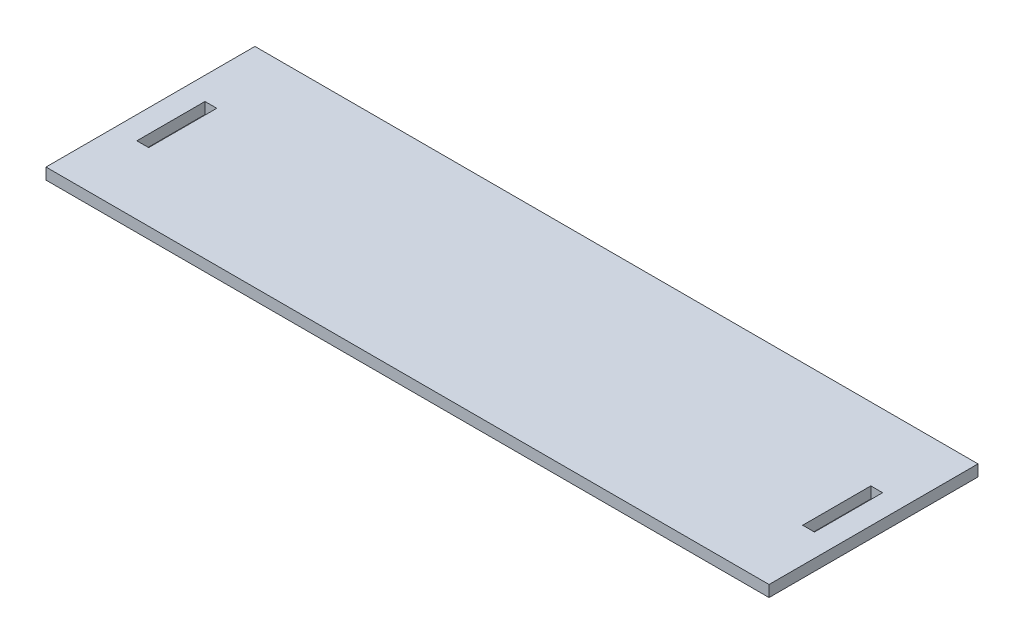
ISO-10303-21;
HEADER;
FILE_DESCRIPTION(('STEP AP214'),'2;1');
FILE_NAME('part.step','',(''),(''),'','','');
FILE_SCHEMA(('AUTOMOTIVE_DESIGN { 1 0 10303 214 1 1 1 1 }'));
ENDSEC;
DATA;
#1=APPLICATION_CONTEXT('core data for automotive mechanical design processes');
#2=APPLICATION_PROTOCOL_DEFINITION('international standard','automotive_design',2000,#1);
#3=PRODUCT_CONTEXT('',#1,'mechanical');
#4=PRODUCT('Part','Part','',(#3));
#5=PRODUCT_RELATED_PRODUCT_CATEGORY('part','',(#4));
#6=PRODUCT_DEFINITION_FORMATION('','',#4);
#7=PRODUCT_DEFINITION_CONTEXT('part definition',#1,'design');
#8=PRODUCT_DEFINITION('design','',#6,#7);
#9=PRODUCT_DEFINITION_SHAPE('','',#8);
#10=(LENGTH_UNIT() NAMED_UNIT(*) SI_UNIT(.MILLI.,.METRE.));
#11=(NAMED_UNIT(*) PLANE_ANGLE_UNIT() SI_UNIT($,.RADIAN.));
#12=(NAMED_UNIT(*) SI_UNIT($,.STERADIAN.) SOLID_ANGLE_UNIT());
#13=UNCERTAINTY_MEASURE_WITH_UNIT(LENGTH_MEASURE(1.E-05),#10,'distance_accuracy_value','');
#14=(GEOMETRIC_REPRESENTATION_CONTEXT(3) GLOBAL_UNCERTAINTY_ASSIGNED_CONTEXT((#13)) GLOBAL_UNIT_ASSIGNED_CONTEXT((#10,
#11,#12)) REPRESENTATION_CONTEXT('',''));
#15=CARTESIAN_POINT('',(0.,0.,0.));
#16=DIRECTION('',(0.,0.,1.));
#17=DIRECTION('',(1.,0.,0.));
#18=AXIS2_PLACEMENT_3D('',#15,#16,#17);
#19=CARTESIAN_POINT('',(0.,2.5,0.));
#20=DIRECTION('',(0.,-1.,0.));
#21=DIRECTION('',(0.,0.,-1.));
#22=AXIS2_PLACEMENT_3D('',#19,#20,#21);
#23=PLANE('',#22);
#24=DIRECTION('',(0.,0.,-1.));
#25=VECTOR('',#24,1.);
#26=CARTESIAN_POINT('',(-72.,2.5,7.49999999999999));
#27=LINE('',#26,#25);
#28=CARTESIAN_POINT('',(-72.,2.5,7.49999999999999));
#29=VERTEX_POINT('',#28);
#30=CARTESIAN_POINT('',(-72.,2.5,-7.50000000000001));
#31=VERTEX_POINT('',#30);
#32=EDGE_CURVE('E177',#29,#31,#27,.T.);
#33=ORIENTED_EDGE('',*,*,#32,.F.);
#34=DIRECTION('',(1.,0.,0.));
#35=VECTOR('',#34,1.);
#36=CARTESIAN_POINT('',(-74.6,2.5,7.49999999999999));
#37=LINE('',#36,#35);
#38=CARTESIAN_POINT('',(-74.6,2.5,7.49999999999999));
#39=VERTEX_POINT('',#38);
#40=EDGE_CURVE('E173',#39,#29,#37,.T.);
#41=ORIENTED_EDGE('',*,*,#40,.F.);
#42=DIRECTION('',(0.,0.,1.));
#43=VECTOR('',#42,1.);
#44=CARTESIAN_POINT('',(-74.6,2.5,7.49999999999999));
#45=LINE('',#44,#43);
#46=CARTESIAN_POINT('',(-74.6,2.5,-7.50000000000001));
#47=VERTEX_POINT('',#46);
#48=EDGE_CURVE('E189',#47,#39,#45,.T.);
#49=ORIENTED_EDGE('',*,*,#48,.F.);
#50=DIRECTION('',(-1.,0.,0.));
#51=VECTOR('',#50,1.);
#52=CARTESIAN_POINT('',(-74.6,2.5,-7.50000000000001));
#53=LINE('',#52,#51);
#54=EDGE_CURVE('E192',#31,#47,#53,.T.);
#55=ORIENTED_EDGE('',*,*,#54,.F.);
#56=EDGE_LOOP('',(#33,#41,#49,#55));
#57=FACE_BOUND('',#56,.T.);
#58=DIRECTION('',(0.,0.,-1.));
#59=VECTOR('',#58,1.);
#60=CARTESIAN_POINT('',(79.6,2.5,22.5));
#61=LINE('',#60,#59);
#62=CARTESIAN_POINT('',(79.6,2.5,22.5));
#63=VERTEX_POINT('',#62);
#64=CARTESIAN_POINT('',(79.6,2.5,-23.5));
#65=VERTEX_POINT('',#64);
#66=EDGE_CURVE('E159',#63,#65,#61,.T.);
#67=ORIENTED_EDGE('',*,*,#66,.T.);
#68=DIRECTION('',(1.,0.,0.));
#69=VECTOR('',#68,1.);
#70=CARTESIAN_POINT('',(0.,2.5,-23.5));
#71=LINE('',#70,#69);
#72=CARTESIAN_POINT('',(-79.6,2.5,-23.5));
#73=VERTEX_POINT('',#72);
#74=EDGE_CURVE('E129',#73,#65,#71,.T.);
#75=ORIENTED_EDGE('',*,*,#74,.F.);
#76=DIRECTION('',(0.,0.,1.));
#77=VECTOR('',#76,1.);
#78=CARTESIAN_POINT('',(-79.6,2.5,22.5));
#79=LINE('',#78,#77);
#80=CARTESIAN_POINT('',(-79.6,2.5,22.5));
#81=VERTEX_POINT('',#80);
#82=EDGE_CURVE('E160',#73,#81,#79,.T.);
#83=ORIENTED_EDGE('',*,*,#82,.T.);
#84=DIRECTION('',(1.,0.,0.));
#85=VECTOR('',#84,1.);
#86=CARTESIAN_POINT('',(-79.6,2.5,22.5));
#87=LINE('',#86,#85);
#88=EDGE_CURVE('E156',#81,#63,#87,.T.);
#89=ORIENTED_EDGE('',*,*,#88,.T.);
#90=EDGE_LOOP('',(#67,#75,#83,#89));
#91=FACE_BOUND('',#90,.T.);
#92=DIRECTION('',(0.,0.,-1.));
#93=VECTOR('',#92,1.);
#94=CARTESIAN_POINT('',(74.6,2.5,7.49999999999997));
#95=LINE('',#94,#93);
#96=CARTESIAN_POINT('',(74.6,2.5,7.49999999999997));
#97=VERTEX_POINT('',#96);
#98=CARTESIAN_POINT('',(74.6,2.5,-7.50000000000003));
#99=VERTEX_POINT('',#98);
#100=EDGE_CURVE('E207',#97,#99,#95,.T.);
#101=ORIENTED_EDGE('',*,*,#100,.F.);
#102=DIRECTION('',(1.,0.,0.));
#103=VECTOR('',#102,1.);
#104=CARTESIAN_POINT('',(74.6,2.5,7.49999999999997));
#105=LINE('',#104,#103);
#106=CARTESIAN_POINT('',(72.,2.5,7.49999999999997));
#107=VERTEX_POINT('',#106);
#108=EDGE_CURVE('E203',#107,#97,#105,.T.);
#109=ORIENTED_EDGE('',*,*,#108,.F.);
#110=DIRECTION('',(0.,0.,1.));
#111=VECTOR('',#110,1.);
#112=CARTESIAN_POINT('',(72.,2.5,7.49999999999997));
#113=LINE('',#112,#111);
#114=CARTESIAN_POINT('',(72.,2.5,-7.50000000000003));
#115=VERTEX_POINT('',#114);
#116=EDGE_CURVE('E217',#115,#107,#113,.T.);
#117=ORIENTED_EDGE('',*,*,#116,.F.);
#118=DIRECTION('',(-1.,0.,0.));
#119=VECTOR('',#118,1.);
#120=CARTESIAN_POINT('',(74.6,2.5,-7.50000000000003));
#121=LINE('',#120,#119);
#122=EDGE_CURVE('E219',#99,#115,#121,.T.);
#123=ORIENTED_EDGE('',*,*,#122,.F.);
#124=EDGE_LOOP('',(#101,#109,#117,#123));
#125=FACE_BOUND('',#124,.T.);
#126=ADVANCED_FACE('F39',(#57,#91,#125),#23,.F.);
#127=CARTESIAN_POINT('',(0.,0.,0.));
#128=DIRECTION('',(0.,-1.,0.));
#129=DIRECTION('',(0.,0.,-1.));
#130=AXIS2_PLACEMENT_3D('',#127,#128,#129);
#131=PLANE('',#130);
#132=DIRECTION('',(1.,0.,0.));
#133=VECTOR('',#132,1.);
#134=CARTESIAN_POINT('',(0.,0.,-23.5));
#135=LINE('',#134,#133);
#136=CARTESIAN_POINT('',(-79.6,0.,-23.5));
#137=VERTEX_POINT('',#136);
#138=CARTESIAN_POINT('',(79.6,0.,-23.5));
#139=VERTEX_POINT('',#138);
#140=EDGE_CURVE('E54',#137,#139,#135,.T.);
#141=ORIENTED_EDGE('',*,*,#140,.T.);
#142=DIRECTION('',(0.,0.,-1.));
#143=VECTOR('',#142,1.);
#144=CARTESIAN_POINT('',(79.6,0.,22.5));
#145=LINE('',#144,#143);
#146=CARTESIAN_POINT('',(79.6,0.,22.5));
#147=VERTEX_POINT('',#146);
#148=EDGE_CURVE('E143',#147,#139,#145,.T.);
#149=ORIENTED_EDGE('',*,*,#148,.F.);
#150=DIRECTION('',(1.,0.,0.));
#151=VECTOR('',#150,1.);
#152=CARTESIAN_POINT('',(-79.6,0.,22.5));
#153=LINE('',#152,#151);
#154=CARTESIAN_POINT('',(-79.6,0.,22.5));
#155=VERTEX_POINT('',#154);
#156=EDGE_CURVE('E150',#155,#147,#153,.T.);
#157=ORIENTED_EDGE('',*,*,#156,.F.);
#158=DIRECTION('',(0.,0.,1.));
#159=VECTOR('',#158,1.);
#160=CARTESIAN_POINT('',(-79.6,0.,22.5));
#161=LINE('',#160,#159);
#162=EDGE_CURVE('E144',#137,#155,#161,.T.);
#163=ORIENTED_EDGE('',*,*,#162,.F.);
#164=EDGE_LOOP('',(#141,#149,#157,#163));
#165=FACE_BOUND('',#164,.T.);
#166=DIRECTION('',(1.,0.,0.));
#167=VECTOR('',#166,1.);
#168=CARTESIAN_POINT('',(-74.6,0.,7.49999999999999));
#169=LINE('',#168,#167);
#170=CARTESIAN_POINT('',(-74.6,0.,7.49999999999999));
#171=VERTEX_POINT('',#170);
#172=CARTESIAN_POINT('',(-72.,0.,7.49999999999999));
#173=VERTEX_POINT('',#172);
#174=EDGE_CURVE('E174',#171,#173,#169,.T.);
#175=ORIENTED_EDGE('',*,*,#174,.T.);
#176=DIRECTION('',(0.,0.,-1.));
#177=VECTOR('',#176,1.);
#178=CARTESIAN_POINT('',(-72.,0.,7.49999999999999));
#179=LINE('',#178,#177);
#180=CARTESIAN_POINT('',(-72.,0.,-7.50000000000001));
#181=VERTEX_POINT('',#180);
#182=EDGE_CURVE('E184',#173,#181,#179,.T.);
#183=ORIENTED_EDGE('',*,*,#182,.T.);
#184=DIRECTION('',(-1.,0.,0.));
#185=VECTOR('',#184,1.);
#186=CARTESIAN_POINT('',(-74.6,0.,-7.50000000000001));
#187=LINE('',#186,#185);
#188=CARTESIAN_POINT('',(-74.6,0.,-7.50000000000001));
#189=VERTEX_POINT('',#188);
#190=EDGE_CURVE('E181',#181,#189,#187,.T.);
#191=ORIENTED_EDGE('',*,*,#190,.T.);
#192=DIRECTION('',(0.,0.,1.));
#193=VECTOR('',#192,1.);
#194=CARTESIAN_POINT('',(-74.6,0.,7.49999999999999));
#195=LINE('',#194,#193);
#196=EDGE_CURVE('E178',#189,#171,#195,.T.);
#197=ORIENTED_EDGE('',*,*,#196,.T.);
#198=EDGE_LOOP('',(#175,#183,#191,#197));
#199=FACE_BOUND('',#198,.T.);
#200=DIRECTION('',(1.,0.,0.));
#201=VECTOR('',#200,1.);
#202=CARTESIAN_POINT('',(74.6,0.,7.49999999999997));
#203=LINE('',#202,#201);
#204=CARTESIAN_POINT('',(72.,0.,7.49999999999997));
#205=VERTEX_POINT('',#204);
#206=CARTESIAN_POINT('',(74.6,0.,7.49999999999997));
#207=VERTEX_POINT('',#206);
#208=EDGE_CURVE('E204',#205,#207,#203,.T.);
#209=ORIENTED_EDGE('',*,*,#208,.T.);
#210=DIRECTION('',(0.,0.,-1.));
#211=VECTOR('',#210,1.);
#212=CARTESIAN_POINT('',(74.6,0.,7.49999999999997));
#213=LINE('',#212,#211);
#214=CARTESIAN_POINT('',(74.6,0.,-7.50000000000003));
#215=VERTEX_POINT('',#214);
#216=EDGE_CURVE('E134',#207,#215,#213,.T.);
#217=ORIENTED_EDGE('',*,*,#216,.T.);
#218=DIRECTION('',(-1.,0.,0.));
#219=VECTOR('',#218,1.);
#220=CARTESIAN_POINT('',(74.6,0.,-7.50000000000003));
#221=LINE('',#220,#219);
#222=CARTESIAN_POINT('',(72.,0.,-7.50000000000003));
#223=VERTEX_POINT('',#222);
#224=EDGE_CURVE('E211',#215,#223,#221,.T.);
#225=ORIENTED_EDGE('',*,*,#224,.T.);
#226=DIRECTION('',(0.,0.,1.));
#227=VECTOR('',#226,1.);
#228=CARTESIAN_POINT('',(72.,0.,7.49999999999997));
#229=LINE('',#228,#227);
#230=EDGE_CURVE('E208',#223,#205,#229,.T.);
#231=ORIENTED_EDGE('',*,*,#230,.T.);
#232=EDGE_LOOP('',(#209,#217,#225,#231));
#233=FACE_BOUND('',#232,.T.);
#234=ADVANCED_FACE('F140',(#165,#199,#233),#131,.T.);
#235=CARTESIAN_POINT('',(79.6,2.5,22.5));
#236=DIRECTION('',(-1.,0.,0.));
#237=DIRECTION('',(0.,0.,1.));
#238=AXIS2_PLACEMENT_3D('',#235,#236,#237);
#239=PLANE('',#238);
#240=ORIENTED_EDGE('',*,*,#148,.T.);
#241=DIRECTION('',(0.,1.,0.));
#242=VECTOR('',#241,1.);
#243=CARTESIAN_POINT('',(79.6,0.,-23.5));
#244=LINE('',#243,#242);
#245=EDGE_CURVE('E126',#139,#65,#244,.T.);
#246=ORIENTED_EDGE('',*,*,#245,.T.);
#247=ORIENTED_EDGE('',*,*,#66,.F.);
#248=DIRECTION('',(0.,-1.,0.));
#249=VECTOR('',#248,1.);
#250=CARTESIAN_POINT('',(79.6,2.5,22.5));
#251=LINE('',#250,#249);
#252=EDGE_CURVE('E47',#63,#147,#251,.T.);
#253=ORIENTED_EDGE('',*,*,#252,.T.);
#254=EDGE_LOOP('',(#240,#246,#247,#253));
#255=FACE_BOUND('',#254,.T.);
#256=ADVANCED_FACE('F41',(#255),#239,.F.);
#257=CARTESIAN_POINT('',(-79.6,2.5,22.5));
#258=DIRECTION('',(1.,0.,0.));
#259=DIRECTION('',(0.,0.,-1.));
#260=AXIS2_PLACEMENT_3D('',#257,#258,#259);
#261=PLANE('',#260);
#262=ORIENTED_EDGE('',*,*,#82,.F.);
#263=DIRECTION('',(0.,1.,0.));
#264=VECTOR('',#263,1.);
#265=CARTESIAN_POINT('',(-79.6,0.,-23.5));
#266=LINE('',#265,#264);
#267=EDGE_CURVE('E135',#137,#73,#266,.T.);
#268=ORIENTED_EDGE('',*,*,#267,.F.);
#269=ORIENTED_EDGE('',*,*,#162,.T.);
#270=DIRECTION('',(0.,-1.,0.));
#271=VECTOR('',#270,1.);
#272=CARTESIAN_POINT('',(-79.6,2.5,22.5));
#273=LINE('',#272,#271);
#274=EDGE_CURVE('E11',#81,#155,#273,.T.);
#275=ORIENTED_EDGE('',*,*,#274,.F.);
#276=EDGE_LOOP('',(#262,#268,#269,#275));
#277=FACE_BOUND('',#276,.T.);
#278=ADVANCED_FACE('F225',(#277),#261,.F.);
#279=CARTESIAN_POINT('',(-79.6,2.5,22.5));
#280=DIRECTION('',(0.,0.,-1.));
#281=DIRECTION('',(-1.,0.,0.));
#282=AXIS2_PLACEMENT_3D('',#279,#280,#281);
#283=PLANE('',#282);
#284=ORIENTED_EDGE('',*,*,#156,.T.);
#285=ORIENTED_EDGE('',*,*,#252,.F.);
#286=ORIENTED_EDGE('',*,*,#88,.F.);
#287=ORIENTED_EDGE('',*,*,#274,.T.);
#288=EDGE_LOOP('',(#284,#285,#286,#287));
#289=FACE_BOUND('',#288,.T.);
#290=ADVANCED_FACE('F227',(#289),#283,.F.);
#291=CARTESIAN_POINT('',(-72.,2.5,7.49999999999999));
#292=DIRECTION('',(-1.,0.,0.));
#293=DIRECTION('',(0.,0.,1.));
#294=AXIS2_PLACEMENT_3D('',#291,#292,#293);
#295=PLANE('',#294);
#296=ORIENTED_EDGE('',*,*,#182,.F.);
#297=DIRECTION('',(0.,-1.,0.));
#298=VECTOR('',#297,1.);
#299=CARTESIAN_POINT('',(-72.,2.5,7.49999999999999));
#300=LINE('',#299,#298);
#301=EDGE_CURVE('E170',#29,#173,#300,.T.);
#302=ORIENTED_EDGE('',*,*,#301,.F.);
#303=ORIENTED_EDGE('',*,*,#32,.T.);
#304=DIRECTION('',(0.,-1.,0.));
#305=VECTOR('',#304,1.);
#306=CARTESIAN_POINT('',(-72.,2.5,-7.50000000000001));
#307=LINE('',#306,#305);
#308=EDGE_CURVE('E148',#31,#181,#307,.T.);
#309=ORIENTED_EDGE('',*,*,#308,.T.);
#310=EDGE_LOOP('',(#296,#302,#303,#309));
#311=FACE_BOUND('',#310,.T.);
#312=ADVANCED_FACE('F229',(#311),#295,.T.);
#313=CARTESIAN_POINT('',(-74.6,2.5,-7.50000000000001));
#314=DIRECTION('',(0.,0.,1.));
#315=DIRECTION('',(1.,0.,0.));
#316=AXIS2_PLACEMENT_3D('',#313,#314,#315);
#317=PLANE('',#316);
#318=ORIENTED_EDGE('',*,*,#190,.F.);
#319=ORIENTED_EDGE('',*,*,#308,.F.);
#320=ORIENTED_EDGE('',*,*,#54,.T.);
#321=DIRECTION('',(0.,-1.,0.));
#322=VECTOR('',#321,1.);
#323=CARTESIAN_POINT('',(-74.6,2.5,-7.50000000000001));
#324=LINE('',#323,#322);
#325=EDGE_CURVE('E153',#47,#189,#324,.T.);
#326=ORIENTED_EDGE('',*,*,#325,.T.);
#327=EDGE_LOOP('',(#318,#319,#320,#326));
#328=FACE_BOUND('',#327,.T.);
#329=ADVANCED_FACE('F235',(#328),#317,.T.);
#330=CARTESIAN_POINT('',(-74.6,2.5,7.49999999999999));
#331=DIRECTION('',(1.,0.,0.));
#332=DIRECTION('',(0.,0.,-1.));
#333=AXIS2_PLACEMENT_3D('',#330,#331,#332);
#334=PLANE('',#333);
#335=ORIENTED_EDGE('',*,*,#196,.F.);
#336=ORIENTED_EDGE('',*,*,#325,.F.);
#337=ORIENTED_EDGE('',*,*,#48,.T.);
#338=DIRECTION('',(0.,-1.,0.));
#339=VECTOR('',#338,1.);
#340=CARTESIAN_POINT('',(-74.6,2.5,7.49999999999999));
#341=LINE('',#340,#339);
#342=EDGE_CURVE('E168',#39,#171,#341,.T.);
#343=ORIENTED_EDGE('',*,*,#342,.T.);
#344=EDGE_LOOP('',(#335,#336,#337,#343));
#345=FACE_BOUND('',#344,.T.);
#346=ADVANCED_FACE('F249',(#345),#334,.T.);
#347=CARTESIAN_POINT('',(-74.6,2.5,7.49999999999999));
#348=DIRECTION('',(0.,0.,-1.));
#349=DIRECTION('',(-1.,0.,0.));
#350=AXIS2_PLACEMENT_3D('',#347,#348,#349);
#351=PLANE('',#350);
#352=ORIENTED_EDGE('',*,*,#174,.F.);
#353=ORIENTED_EDGE('',*,*,#342,.F.);
#354=ORIENTED_EDGE('',*,*,#40,.T.);
#355=ORIENTED_EDGE('',*,*,#301,.T.);
#356=EDGE_LOOP('',(#352,#353,#354,#355));
#357=FACE_BOUND('',#356,.T.);
#358=ADVANCED_FACE('F253',(#357),#351,.T.);
#359=CARTESIAN_POINT('',(74.6,2.5,7.49999999999997));
#360=DIRECTION('',(-1.,0.,0.));
#361=DIRECTION('',(0.,0.,1.));
#362=AXIS2_PLACEMENT_3D('',#359,#360,#361);
#363=PLANE('',#362);
#364=ORIENTED_EDGE('',*,*,#216,.F.);
#365=DIRECTION('',(0.,-1.,0.));
#366=VECTOR('',#365,1.);
#367=CARTESIAN_POINT('',(74.6,2.5,7.49999999999997));
#368=LINE('',#367,#366);
#369=EDGE_CURVE('E200',#97,#207,#368,.T.);
#370=ORIENTED_EDGE('',*,*,#369,.F.);
#371=ORIENTED_EDGE('',*,*,#100,.T.);
#372=DIRECTION('',(0.,-1.,0.));
#373=VECTOR('',#372,1.);
#374=CARTESIAN_POINT('',(74.6,2.5,-7.50000000000003));
#375=LINE('',#374,#373);
#376=EDGE_CURVE('E187',#99,#215,#375,.T.);
#377=ORIENTED_EDGE('',*,*,#376,.T.);
#378=EDGE_LOOP('',(#364,#370,#371,#377));
#379=FACE_BOUND('',#378,.T.);
#380=ADVANCED_FACE('F257',(#379),#363,.T.);
#381=CARTESIAN_POINT('',(74.6,2.5,-7.50000000000003));
#382=DIRECTION('',(0.,0.,1.));
#383=DIRECTION('',(1.,0.,0.));
#384=AXIS2_PLACEMENT_3D('',#381,#382,#383);
#385=PLANE('',#384);
#386=ORIENTED_EDGE('',*,*,#224,.F.);
#387=ORIENTED_EDGE('',*,*,#376,.F.);
#388=ORIENTED_EDGE('',*,*,#122,.T.);
#389=DIRECTION('',(0.,-1.,0.));
#390=VECTOR('',#389,1.);
#391=CARTESIAN_POINT('',(72.,2.5,-7.50000000000003));
#392=LINE('',#391,#390);
#393=EDGE_CURVE('E197',#115,#223,#392,.T.);
#394=ORIENTED_EDGE('',*,*,#393,.T.);
#395=EDGE_LOOP('',(#386,#387,#388,#394));
#396=FACE_BOUND('',#395,.T.);
#397=ADVANCED_FACE('F261',(#396),#385,.T.);
#398=CARTESIAN_POINT('',(72.,2.5,7.49999999999997));
#399=DIRECTION('',(1.,0.,0.));
#400=DIRECTION('',(0.,0.,-1.));
#401=AXIS2_PLACEMENT_3D('',#398,#399,#400);
#402=PLANE('',#401);
#403=ORIENTED_EDGE('',*,*,#230,.F.);
#404=ORIENTED_EDGE('',*,*,#393,.F.);
#405=ORIENTED_EDGE('',*,*,#116,.T.);
#406=DIRECTION('',(0.,-1.,0.));
#407=VECTOR('',#406,1.);
#408=CARTESIAN_POINT('',(72.,2.5,7.49999999999997));
#409=LINE('',#408,#407);
#410=EDGE_CURVE('E62',#107,#205,#409,.T.);
#411=ORIENTED_EDGE('',*,*,#410,.T.);
#412=EDGE_LOOP('',(#403,#404,#405,#411));
#413=FACE_BOUND('',#412,.T.);
#414=ADVANCED_FACE('F265',(#413),#402,.T.);
#415=CARTESIAN_POINT('',(74.6,2.5,7.49999999999997));
#416=DIRECTION('',(0.,0.,-1.));
#417=DIRECTION('',(-1.,0.,0.));
#418=AXIS2_PLACEMENT_3D('',#415,#416,#417);
#419=PLANE('',#418);
#420=ORIENTED_EDGE('',*,*,#208,.F.);
#421=ORIENTED_EDGE('',*,*,#410,.F.);
#422=ORIENTED_EDGE('',*,*,#108,.T.);
#423=ORIENTED_EDGE('',*,*,#369,.T.);
#424=EDGE_LOOP('',(#420,#421,#422,#423));
#425=FACE_BOUND('',#424,.T.);
#426=ADVANCED_FACE('F269',(#425),#419,.T.);
#427=CARTESIAN_POINT('',(0.,0.,-23.5));
#428=DIRECTION('',(0.,0.,1.));
#429=DIRECTION('',(1.,0.,0.));
#430=AXIS2_PLACEMENT_3D('',#427,#428,#429);
#431=PLANE('',#430);
#432=ORIENTED_EDGE('',*,*,#74,.T.);
#433=ORIENTED_EDGE('',*,*,#245,.F.);
#434=ORIENTED_EDGE('',*,*,#140,.F.);
#435=ORIENTED_EDGE('',*,*,#267,.T.);
#436=EDGE_LOOP('',(#432,#433,#434,#435));
#437=FACE_BOUND('',#436,.T.);
#438=ADVANCED_FACE('F127',(#437),#431,.F.);
#439=CLOSED_SHELL('',(#126,#234,#256,#278,#290,#312,#329,#346,#358,#380,#397,#414,#426,#438));
#440=MANIFOLD_SOLID_BREP('B2',#439);
#441=ADVANCED_BREP_SHAPE_REPRESENTATION('',(#18,#440),#14);
#442=SHAPE_DEFINITION_REPRESENTATION(#9,#441);
ENDSEC;
END-ISO-10303-21;
